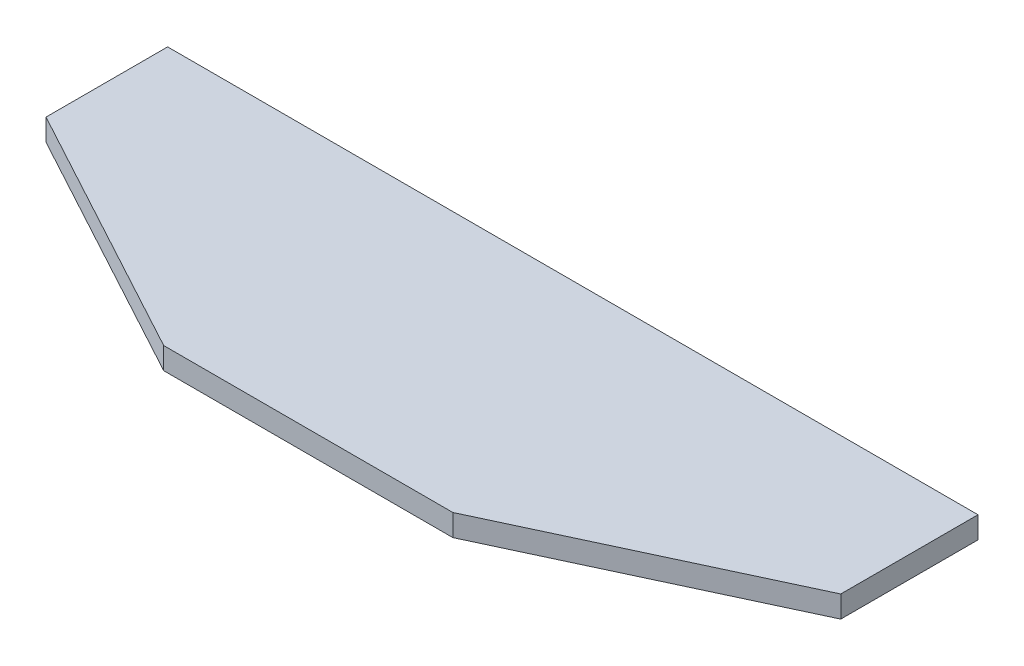
ISO-10303-21;
HEADER;
FILE_DESCRIPTION(('STEP AP214'),'2;1');
FILE_NAME('part.step','',(''),(''),'','','');
FILE_SCHEMA(('AUTOMOTIVE_DESIGN { 1 0 10303 214 1 1 1 1 }'));
ENDSEC;
DATA;
#1=APPLICATION_CONTEXT('core data for automotive mechanical design processes');
#2=APPLICATION_PROTOCOL_DEFINITION('international standard','automotive_design',2000,#1);
#3=PRODUCT_CONTEXT('',#1,'mechanical');
#4=PRODUCT('Part','Part','',(#3));
#5=PRODUCT_RELATED_PRODUCT_CATEGORY('part','',(#4));
#6=PRODUCT_DEFINITION_FORMATION('','',#4);
#7=PRODUCT_DEFINITION_CONTEXT('part definition',#1,'design');
#8=PRODUCT_DEFINITION('design','',#6,#7);
#9=PRODUCT_DEFINITION_SHAPE('','',#8);
#10=(LENGTH_UNIT() NAMED_UNIT(*) SI_UNIT(.MILLI.,.METRE.));
#11=(NAMED_UNIT(*) PLANE_ANGLE_UNIT() SI_UNIT($,.RADIAN.));
#12=(NAMED_UNIT(*) SI_UNIT($,.STERADIAN.) SOLID_ANGLE_UNIT());
#13=UNCERTAINTY_MEASURE_WITH_UNIT(LENGTH_MEASURE(1.E-05),#10,'distance_accuracy_value','');
#14=(GEOMETRIC_REPRESENTATION_CONTEXT(3) GLOBAL_UNCERTAINTY_ASSIGNED_CONTEXT((#13)) GLOBAL_UNIT_ASSIGNED_CONTEXT((#10,
#11,#12)) REPRESENTATION_CONTEXT('',''));
#15=CARTESIAN_POINT('',(0.,0.,0.));
#16=DIRECTION('',(0.,0.,1.));
#17=DIRECTION('',(1.,0.,0.));
#18=AXIS2_PLACEMENT_3D('',#15,#16,#17);
#19=CARTESIAN_POINT('',(-93.,5.,0.415579358977421));
#20=DIRECTION('',(1.,0.,0.));
#21=DIRECTION('',(0.,0.,-1.));
#22=AXIS2_PLACEMENT_3D('',#19,#20,#21);
#23=PLANE('',#22);
#24=DIRECTION('',(0.,0.,1.));
#25=VECTOR('',#24,1.);
#26=CARTESIAN_POINT('',(-93.,0.,0.415579358977421));
#27=LINE('',#26,#25);
#28=CARTESIAN_POINT('',(-93.,0.,-27.5));
#29=VERTEX_POINT('',#28);
#30=CARTESIAN_POINT('',(-93.,0.,0.415579358977421));
#31=VERTEX_POINT('',#30);
#32=EDGE_CURVE('E117',#29,#31,#27,.T.);
#33=ORIENTED_EDGE('',*,*,#32,.T.);
#34=DIRECTION('',(0.,-1.,0.));
#35=VECTOR('',#34,1.);
#36=CARTESIAN_POINT('',(-93.,5.,0.415579358977421));
#37=LINE('',#36,#35);
#38=CARTESIAN_POINT('',(-93.,5.,0.415579358977421));
#39=VERTEX_POINT('',#38);
#40=EDGE_CURVE('E11',#39,#31,#37,.T.);
#41=ORIENTED_EDGE('',*,*,#40,.F.);
#42=DIRECTION('',(0.,0.,1.));
#43=VECTOR('',#42,1.);
#44=CARTESIAN_POINT('',(-93.,5.,0.415579358977421));
#45=LINE('',#44,#43);
#46=CARTESIAN_POINT('',(-93.,5.,-27.5));
#47=VERTEX_POINT('',#46);
#48=EDGE_CURVE('E127',#47,#39,#45,.T.);
#49=ORIENTED_EDGE('',*,*,#48,.F.);
#50=DIRECTION('',(0.,-1.,0.));
#51=VECTOR('',#50,1.);
#52=CARTESIAN_POINT('',(-93.,5.,-27.5));
#53=LINE('',#52,#51);
#54=EDGE_CURVE('E113',#47,#29,#53,.T.);
#55=ORIENTED_EDGE('',*,*,#54,.T.);
#56=EDGE_LOOP('',(#33,#41,#49,#55));
#57=FACE_BOUND('',#56,.T.);
#58=ADVANCED_FACE('F33',(#57),#23,.F.);
#59=CARTESIAN_POINT('',(-34.0814125980399,5.,32.3154235366156));
#60=DIRECTION('',(0.476117077278181,0.,-0.879381901521792));
#61=DIRECTION('',(-0.879381901521792,0.,-0.476117077278181));
#62=AXIS2_PLACEMENT_3D('',#59,#60,#61);
#63=PLANE('',#62);
#64=DIRECTION('',(0.879381901521792,0.,0.476117077278181));
#65=VECTOR('',#64,1.);
#66=CARTESIAN_POINT('',(-34.0814125980399,0.,32.3154235366156));
#67=LINE('',#66,#65);
#68=CARTESIAN_POINT('',(-34.0814125980399,0.,32.3154235366156));
#69=VERTEX_POINT('',#68);
#70=EDGE_CURVE('E120',#31,#69,#67,.T.);
#71=ORIENTED_EDGE('',*,*,#70,.T.);
#72=DIRECTION('',(0.,-1.,0.));
#73=VECTOR('',#72,1.);
#74=CARTESIAN_POINT('',(-34.0814125980399,5.,32.3154235366156));
#75=LINE('',#74,#73);
#76=CARTESIAN_POINT('',(-34.0814125980399,5.,32.3154235366156));
#77=VERTEX_POINT('',#76);
#78=EDGE_CURVE('E41',#77,#69,#75,.T.);
#79=ORIENTED_EDGE('',*,*,#78,.F.);
#80=DIRECTION('',(0.879381901521792,0.,0.476117077278181));
#81=VECTOR('',#80,1.);
#82=CARTESIAN_POINT('',(-34.0814125980399,5.,32.3154235366156));
#83=LINE('',#82,#81);
#84=EDGE_CURVE('E86',#39,#77,#83,.T.);
#85=ORIENTED_EDGE('',*,*,#84,.F.);
#86=ORIENTED_EDGE('',*,*,#40,.T.);
#87=EDGE_LOOP('',(#71,#79,#85,#86));
#88=FACE_BOUND('',#87,.T.);
#89=ADVANCED_FACE('F151',(#88),#63,.F.);
#90=CARTESIAN_POINT('',(-34.0814125980399,5.,32.3154235366156));
#91=DIRECTION('',(0.,0.,-1.));
#92=DIRECTION('',(-1.,0.,0.));
#93=AXIS2_PLACEMENT_3D('',#90,#91,#92);
#94=PLANE('',#93);
#95=DIRECTION('',(1.,0.,0.));
#96=VECTOR('',#95,1.);
#97=CARTESIAN_POINT('',(-34.0814125980399,0.,32.3154235366156));
#98=LINE('',#97,#96);
#99=CARTESIAN_POINT('',(32.2773782685417,0.,32.3154235366216));
#100=VERTEX_POINT('',#99);
#101=EDGE_CURVE('E122',#69,#100,#98,.T.);
#102=ORIENTED_EDGE('',*,*,#101,.T.);
#103=DIRECTION('',(0.,-1.,0.));
#104=VECTOR('',#103,1.);
#105=CARTESIAN_POINT('',(32.2773782685417,5.,32.3154235366216));
#106=LINE('',#105,#104);
#107=CARTESIAN_POINT('',(32.2773782685417,5.,32.3154235366216));
#108=VERTEX_POINT('',#107);
#109=EDGE_CURVE('E108',#108,#100,#106,.T.);
#110=ORIENTED_EDGE('',*,*,#109,.F.);
#111=DIRECTION('',(1.,0.,0.));
#112=VECTOR('',#111,1.);
#113=CARTESIAN_POINT('',(-34.0814125980399,5.,32.3154235366156));
#114=LINE('',#113,#112);
#115=EDGE_CURVE('E99',#77,#108,#114,.T.);
#116=ORIENTED_EDGE('',*,*,#115,.F.);
#117=ORIENTED_EDGE('',*,*,#78,.T.);
#118=EDGE_LOOP('',(#102,#110,#116,#117));
#119=FACE_BOUND('',#118,.T.);
#120=ADVANCED_FACE('F133',(#119),#94,.F.);
#121=CARTESIAN_POINT('',(32.2773782685417,5.,32.3154235366216));
#122=DIRECTION('',(-0.422618261740619,0.,-0.906307787036688));
#123=DIRECTION('',(-0.906307787036688,0.,0.422618261740619));
#124=AXIS2_PLACEMENT_3D('',#121,#122,#123);
#125=PLANE('',#124);
#126=DIRECTION('',(0.906307787036688,0.,-0.422618261740619));
#127=VECTOR('',#126,1.);
#128=CARTESIAN_POINT('',(32.2773782685417,0.,32.3154235366216));
#129=LINE('',#128,#127);
#130=CARTESIAN_POINT('',(93.,0.,3.99999999999997));
#131=VERTEX_POINT('',#130);
#132=EDGE_CURVE('E107',#100,#131,#129,.T.);
#133=ORIENTED_EDGE('',*,*,#132,.T.);
#134=DIRECTION('',(0.,-1.,0.));
#135=VECTOR('',#134,1.);
#136=CARTESIAN_POINT('',(93.,5.,3.99999999999997));
#137=LINE('',#136,#135);
#138=CARTESIAN_POINT('',(93.,5.,3.99999999999997));
#139=VERTEX_POINT('',#138);
#140=EDGE_CURVE('E104',#139,#131,#137,.T.);
#141=ORIENTED_EDGE('',*,*,#140,.F.);
#142=DIRECTION('',(0.906307787036688,0.,-0.422618261740619));
#143=VECTOR('',#142,1.);
#144=CARTESIAN_POINT('',(32.2773782685417,5.,32.3154235366216));
#145=LINE('',#144,#143);
#146=EDGE_CURVE('E93',#108,#139,#145,.T.);
#147=ORIENTED_EDGE('',*,*,#146,.F.);
#148=ORIENTED_EDGE('',*,*,#109,.T.);
#149=EDGE_LOOP('',(#133,#141,#147,#148));
#150=FACE_BOUND('',#149,.T.);
#151=ADVANCED_FACE('F105',(#150),#125,.F.);
#152=CARTESIAN_POINT('',(93.,5.,3.99999999999997));
#153=DIRECTION('',(-1.,0.,0.));
#154=DIRECTION('',(0.,0.,1.));
#155=AXIS2_PLACEMENT_3D('',#152,#153,#154);
#156=PLANE('',#155);
#157=DIRECTION('',(0.,0.,-1.));
#158=VECTOR('',#157,1.);
#159=CARTESIAN_POINT('',(93.,0.,3.99999999999997));
#160=LINE('',#159,#158);
#161=CARTESIAN_POINT('',(93.,0.,-27.5));
#162=VERTEX_POINT('',#161);
#163=EDGE_CURVE('E72',#131,#162,#160,.T.);
#164=ORIENTED_EDGE('',*,*,#163,.T.);
#165=DIRECTION('',(0.,-1.,0.));
#166=VECTOR('',#165,1.);
#167=CARTESIAN_POINT('',(93.,5.,-27.5));
#168=LINE('',#167,#166);
#169=CARTESIAN_POINT('',(93.,5.,-27.5));
#170=VERTEX_POINT('',#169);
#171=EDGE_CURVE('E109',#170,#162,#168,.T.);
#172=ORIENTED_EDGE('',*,*,#171,.F.);
#173=DIRECTION('',(0.,0.,-1.));
#174=VECTOR('',#173,1.);
#175=CARTESIAN_POINT('',(93.,5.,3.99999999999997));
#176=LINE('',#175,#174);
#177=EDGE_CURVE('E97',#139,#170,#176,.T.);
#178=ORIENTED_EDGE('',*,*,#177,.F.);
#179=ORIENTED_EDGE('',*,*,#140,.T.);
#180=EDGE_LOOP('',(#164,#172,#178,#179));
#181=FACE_BOUND('',#180,.T.);
#182=ADVANCED_FACE('F111',(#181),#156,.F.);
#183=CARTESIAN_POINT('',(93.,5.,-27.5));
#184=DIRECTION('',(0.,0.,1.));
#185=DIRECTION('',(1.,0.,0.));
#186=AXIS2_PLACEMENT_3D('',#183,#184,#185);
#187=PLANE('',#186);
#188=DIRECTION('',(-1.,0.,0.));
#189=VECTOR('',#188,1.);
#190=CARTESIAN_POINT('',(93.,0.,-27.5));
#191=LINE('',#190,#189);
#192=EDGE_CURVE('E78',#162,#29,#191,.T.);
#193=ORIENTED_EDGE('',*,*,#192,.T.);
#194=ORIENTED_EDGE('',*,*,#54,.F.);
#195=DIRECTION('',(-1.,0.,0.));
#196=VECTOR('',#195,1.);
#197=CARTESIAN_POINT('',(93.,5.,-27.5));
#198=LINE('',#197,#196);
#199=EDGE_CURVE('E49',#170,#47,#198,.T.);
#200=ORIENTED_EDGE('',*,*,#199,.F.);
#201=ORIENTED_EDGE('',*,*,#171,.T.);
#202=EDGE_LOOP('',(#193,#194,#200,#201));
#203=FACE_BOUND('',#202,.T.);
#204=ADVANCED_FACE('F140',(#203),#187,.F.);
#205=CARTESIAN_POINT('',(0.,5.,0.));
#206=DIRECTION('',(0.,1.,0.));
#207=DIRECTION('',(0.,0.,1.));
#208=AXIS2_PLACEMENT_3D('',#205,#206,#207);
#209=PLANE('',#208);
#210=ORIENTED_EDGE('',*,*,#48,.T.);
#211=ORIENTED_EDGE('',*,*,#84,.T.);
#212=ORIENTED_EDGE('',*,*,#115,.T.);
#213=ORIENTED_EDGE('',*,*,#146,.T.);
#214=ORIENTED_EDGE('',*,*,#177,.T.);
#215=ORIENTED_EDGE('',*,*,#199,.T.);
#216=EDGE_LOOP('',(#210,#211,#212,#213,#214,#215));
#217=FACE_BOUND('',#216,.T.);
#218=ADVANCED_FACE('F95',(#217),#209,.T.);
#219=CARTESIAN_POINT('',(0.,0.,0.));
#220=DIRECTION('',(0.,1.,0.));
#221=DIRECTION('',(0.,0.,1.));
#222=AXIS2_PLACEMENT_3D('',#219,#220,#221);
#223=PLANE('',#222);
#224=ORIENTED_EDGE('',*,*,#32,.F.);
#225=ORIENTED_EDGE('',*,*,#192,.F.);
#226=ORIENTED_EDGE('',*,*,#163,.F.);
#227=ORIENTED_EDGE('',*,*,#132,.F.);
#228=ORIENTED_EDGE('',*,*,#101,.F.);
#229=ORIENTED_EDGE('',*,*,#70,.F.);
#230=EDGE_LOOP('',(#224,#225,#226,#227,#228,#229));
#231=FACE_BOUND('',#230,.T.);
#232=ADVANCED_FACE('F136',(#231),#223,.F.);
#233=CLOSED_SHELL('',(#58,#89,#120,#151,#182,#204,#218,#232));
#234=MANIFOLD_SOLID_BREP('B2',#233);
#235=ADVANCED_BREP_SHAPE_REPRESENTATION('',(#18,#234),#14);
#236=SHAPE_DEFINITION_REPRESENTATION(#9,#235);
ENDSEC;
END-ISO-10303-21;
